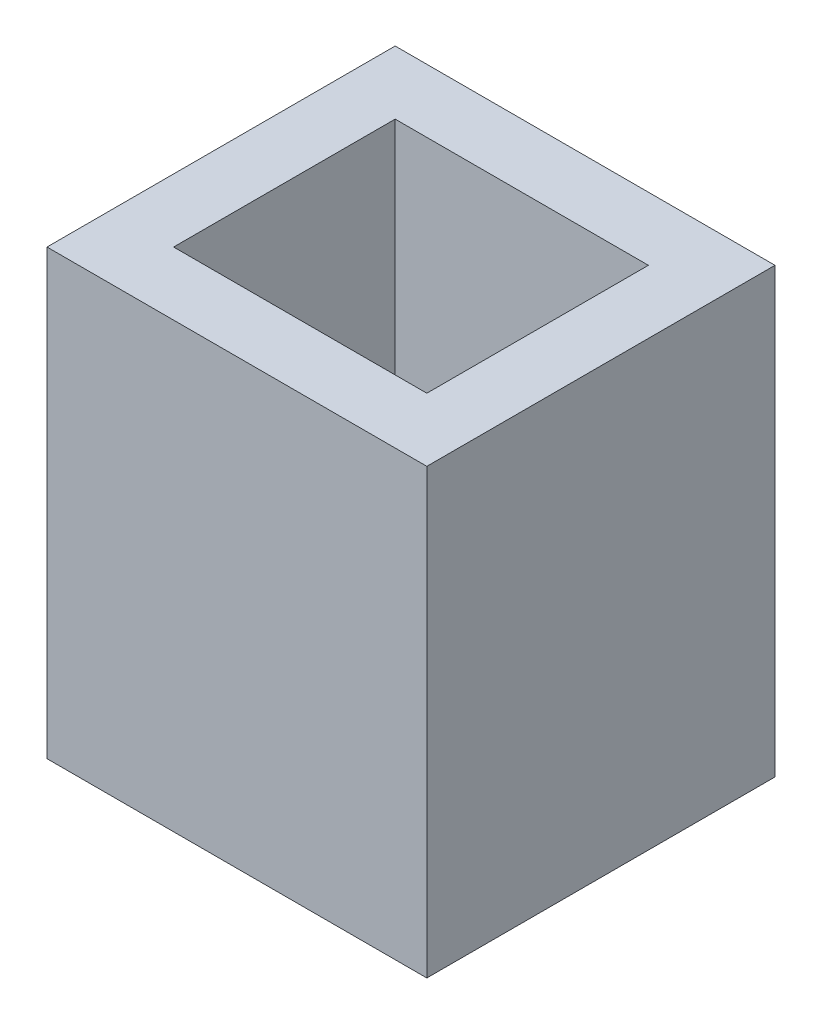
ISO-10303-21;
HEADER;
FILE_DESCRIPTION(('STEP AP214'),'2;1');
FILE_NAME('part.step','',(''),(''),'','','');
FILE_SCHEMA(('AUTOMOTIVE_DESIGN { 1 0 10303 214 1 1 1 1 }'));
ENDSEC;
DATA;
#1=APPLICATION_CONTEXT('core data for automotive mechanical design processes');
#2=APPLICATION_PROTOCOL_DEFINITION('international standard','automotive_design',2000,#1);
#3=PRODUCT_CONTEXT('',#1,'mechanical');
#4=PRODUCT('Part','Part','',(#3));
#5=PRODUCT_RELATED_PRODUCT_CATEGORY('part','',(#4));
#6=PRODUCT_DEFINITION_FORMATION('','',#4);
#7=PRODUCT_DEFINITION_CONTEXT('part definition',#1,'design');
#8=PRODUCT_DEFINITION('design','',#6,#7);
#9=PRODUCT_DEFINITION_SHAPE('','',#8);
#10=(LENGTH_UNIT() NAMED_UNIT(*) SI_UNIT(.MILLI.,.METRE.));
#11=(NAMED_UNIT(*) PLANE_ANGLE_UNIT() SI_UNIT($,.RADIAN.));
#12=(NAMED_UNIT(*) SI_UNIT($,.STERADIAN.) SOLID_ANGLE_UNIT());
#13=UNCERTAINTY_MEASURE_WITH_UNIT(LENGTH_MEASURE(1.E-05),#10,'distance_accuracy_value','');
#14=(GEOMETRIC_REPRESENTATION_CONTEXT(3) GLOBAL_UNCERTAINTY_ASSIGNED_CONTEXT((#13)) GLOBAL_UNIT_ASSIGNED_CONTEXT((#10,
#11,#12)) REPRESENTATION_CONTEXT('',''));
#15=CARTESIAN_POINT('',(0.,0.,0.));
#16=DIRECTION('',(0.,0.,1.));
#17=DIRECTION('',(1.,0.,0.));
#18=AXIS2_PLACEMENT_3D('',#15,#16,#17);
#19=CARTESIAN_POINT('',(0.,14.,0.));
#20=DIRECTION('',(0.,-1.,0.));
#21=DIRECTION('',(0.,0.,-1.));
#22=AXIS2_PLACEMENT_3D('',#19,#20,#21);
#23=PLANE('',#22);
#24=DIRECTION('',(0.,0.,1.));
#25=VECTOR('',#24,1.);
#26=CARTESIAN_POINT('',(0.,14.,0.));
#27=LINE('',#26,#25);
#28=CARTESIAN_POINT('',(0.,14.,-11.));
#29=VERTEX_POINT('',#28);
#30=CARTESIAN_POINT('',(0.,14.,0.));
#31=VERTEX_POINT('',#30);
#32=EDGE_CURVE('E147',#29,#31,#27,.T.);
#33=ORIENTED_EDGE('',*,*,#32,.T.);
#34=DIRECTION('',(1.,0.,0.));
#35=VECTOR('',#34,1.);
#36=CARTESIAN_POINT('',(0.,14.,0.));
#37=LINE('',#36,#35);
#38=CARTESIAN_POINT('',(12.,14.,0.));
#39=VERTEX_POINT('',#38);
#40=EDGE_CURVE('E91',#31,#39,#37,.T.);
#41=ORIENTED_EDGE('',*,*,#40,.T.);
#42=DIRECTION('',(0.,0.,-1.));
#43=VECTOR('',#42,1.);
#44=CARTESIAN_POINT('',(12.,14.,0.));
#45=LINE('',#44,#43);
#46=CARTESIAN_POINT('',(12.,14.,-11.));
#47=VERTEX_POINT('',#46);
#48=EDGE_CURVE('E150',#39,#47,#45,.T.);
#49=ORIENTED_EDGE('',*,*,#48,.T.);
#50=DIRECTION('',(-1.,0.,0.));
#51=VECTOR('',#50,1.);
#52=CARTESIAN_POINT('',(0.,14.,-11.));
#53=LINE('',#52,#51);
#54=EDGE_CURVE('E63',#47,#29,#53,.T.);
#55=ORIENTED_EDGE('',*,*,#54,.T.);
#56=EDGE_LOOP('',(#33,#41,#49,#55));
#57=FACE_BOUND('',#56,.T.);
#58=DIRECTION('',(0.,0.,1.));
#59=VECTOR('',#58,1.);
#60=CARTESIAN_POINT('',(2.,14.,0.));
#61=LINE('',#60,#59);
#62=CARTESIAN_POINT('',(2.,14.,-9.));
#63=VERTEX_POINT('',#62);
#64=CARTESIAN_POINT('',(2.,14.,-2.));
#65=VERTEX_POINT('',#64);
#66=EDGE_CURVE('E136',#63,#65,#61,.T.);
#67=ORIENTED_EDGE('',*,*,#66,.F.);
#68=DIRECTION('',(-1.,0.,0.));
#69=VECTOR('',#68,1.);
#70=CARTESIAN_POINT('',(0.,14.,-9.));
#71=LINE('',#70,#69);
#72=CARTESIAN_POINT('',(10.,14.,-9.));
#73=VERTEX_POINT('',#72);
#74=EDGE_CURVE('E145',#73,#63,#71,.T.);
#75=ORIENTED_EDGE('',*,*,#74,.F.);
#76=DIRECTION('',(0.,0.,-1.));
#77=VECTOR('',#76,1.);
#78=CARTESIAN_POINT('',(10.,14.,0.));
#79=LINE('',#78,#77);
#80=CARTESIAN_POINT('',(10.,14.,-2.));
#81=VERTEX_POINT('',#80);
#82=EDGE_CURVE('E143',#81,#73,#79,.T.);
#83=ORIENTED_EDGE('',*,*,#82,.F.);
#84=DIRECTION('',(1.,0.,0.));
#85=VECTOR('',#84,1.);
#86=CARTESIAN_POINT('',(0.,14.,-2.));
#87=LINE('',#86,#85);
#88=EDGE_CURVE('E128',#65,#81,#87,.T.);
#89=ORIENTED_EDGE('',*,*,#88,.F.);
#90=EDGE_LOOP('',(#67,#75,#83,#89));
#91=FACE_BOUND('',#90,.T.);
#92=ADVANCED_FACE('F37',(#57,#91),#23,.F.);
#93=CARTESIAN_POINT('',(0.,14.,0.));
#94=DIRECTION('',(1.,0.,0.));
#95=DIRECTION('',(0.,0.,-1.));
#96=AXIS2_PLACEMENT_3D('',#93,#94,#95);
#97=PLANE('',#96);
#98=DIRECTION('',(0.,0.,1.));
#99=VECTOR('',#98,1.);
#100=CARTESIAN_POINT('',(0.,0.,0.));
#101=LINE('',#100,#99);
#102=CARTESIAN_POINT('',(0.,0.,-11.));
#103=VERTEX_POINT('',#102);
#104=CARTESIAN_POINT('',(0.,0.,0.));
#105=VERTEX_POINT('',#104);
#106=EDGE_CURVE('E154',#103,#105,#101,.T.);
#107=ORIENTED_EDGE('',*,*,#106,.T.);
#108=DIRECTION('',(0.,-1.,0.));
#109=VECTOR('',#108,1.);
#110=CARTESIAN_POINT('',(0.,14.,0.));
#111=LINE('',#110,#109);
#112=EDGE_CURVE('E11',#31,#105,#111,.T.);
#113=ORIENTED_EDGE('',*,*,#112,.F.);
#114=ORIENTED_EDGE('',*,*,#32,.F.);
#115=DIRECTION('',(0.,-1.,0.));
#116=VECTOR('',#115,1.);
#117=CARTESIAN_POINT('',(0.,14.,-11.));
#118=LINE('',#117,#116);
#119=EDGE_CURVE('E153',#29,#103,#118,.T.);
#120=ORIENTED_EDGE('',*,*,#119,.T.);
#121=EDGE_LOOP('',(#107,#113,#114,#120));
#122=FACE_BOUND('',#121,.T.);
#123=ADVANCED_FACE('F39',(#122),#97,.F.);
#124=CARTESIAN_POINT('',(0.,14.,0.));
#125=DIRECTION('',(0.,0.,-1.));
#126=DIRECTION('',(-1.,0.,0.));
#127=AXIS2_PLACEMENT_3D('',#124,#125,#126);
#128=PLANE('',#127);
#129=DIRECTION('',(1.,0.,0.));
#130=VECTOR('',#129,1.);
#131=CARTESIAN_POINT('',(0.,0.,0.));
#132=LINE('',#131,#130);
#133=CARTESIAN_POINT('',(12.,0.,0.));
#134=VERTEX_POINT('',#133);
#135=EDGE_CURVE('E157',#105,#134,#132,.T.);
#136=ORIENTED_EDGE('',*,*,#135,.T.);
#137=DIRECTION('',(0.,-1.,0.));
#138=VECTOR('',#137,1.);
#139=CARTESIAN_POINT('',(12.,14.,0.));
#140=LINE('',#139,#138);
#141=EDGE_CURVE('E46',#39,#134,#140,.T.);
#142=ORIENTED_EDGE('',*,*,#141,.F.);
#143=ORIENTED_EDGE('',*,*,#40,.F.);
#144=ORIENTED_EDGE('',*,*,#112,.T.);
#145=EDGE_LOOP('',(#136,#142,#143,#144));
#146=FACE_BOUND('',#145,.T.);
#147=ADVANCED_FACE('F196',(#146),#128,.F.);
#148=CARTESIAN_POINT('',(12.,14.,0.));
#149=DIRECTION('',(-1.,0.,0.));
#150=DIRECTION('',(0.,0.,1.));
#151=AXIS2_PLACEMENT_3D('',#148,#149,#150);
#152=PLANE('',#151);
#153=DIRECTION('',(0.,0.,-1.));
#154=VECTOR('',#153,1.);
#155=CARTESIAN_POINT('',(12.,0.,0.));
#156=LINE('',#155,#154);
#157=CARTESIAN_POINT('',(12.,0.,-11.));
#158=VERTEX_POINT('',#157);
#159=EDGE_CURVE('E159',#134,#158,#156,.T.);
#160=ORIENTED_EDGE('',*,*,#159,.T.);
#161=DIRECTION('',(0.,-1.,0.));
#162=VECTOR('',#161,1.);
#163=CARTESIAN_POINT('',(12.,14.,-11.));
#164=LINE('',#163,#162);
#165=EDGE_CURVE('E163',#47,#158,#164,.T.);
#166=ORIENTED_EDGE('',*,*,#165,.F.);
#167=ORIENTED_EDGE('',*,*,#48,.F.);
#168=ORIENTED_EDGE('',*,*,#141,.T.);
#169=EDGE_LOOP('',(#160,#166,#167,#168));
#170=FACE_BOUND('',#169,.T.);
#171=ADVANCED_FACE('F208',(#170),#152,.F.);
#172=CARTESIAN_POINT('',(0.,14.,-11.));
#173=DIRECTION('',(0.,0.,1.));
#174=DIRECTION('',(1.,0.,0.));
#175=AXIS2_PLACEMENT_3D('',#172,#173,#174);
#176=PLANE('',#175);
#177=DIRECTION('',(-1.,0.,0.));
#178=VECTOR('',#177,1.);
#179=CARTESIAN_POINT('',(0.,0.,-11.));
#180=LINE('',#179,#178);
#181=EDGE_CURVE('E84',#158,#103,#180,.T.);
#182=ORIENTED_EDGE('',*,*,#181,.T.);
#183=ORIENTED_EDGE('',*,*,#119,.F.);
#184=ORIENTED_EDGE('',*,*,#54,.F.);
#185=ORIENTED_EDGE('',*,*,#165,.T.);
#186=EDGE_LOOP('',(#182,#183,#184,#185));
#187=FACE_BOUND('',#186,.T.);
#188=ADVANCED_FACE('F204',(#187),#176,.F.);
#189=CARTESIAN_POINT('',(0.,0.,0.));
#190=DIRECTION('',(0.,-1.,0.));
#191=DIRECTION('',(0.,0.,-1.));
#192=AXIS2_PLACEMENT_3D('',#189,#190,#191);
#193=PLANE('',#192);
#194=CARTESIAN_POINT('',(3.45289967304959,0.,-7.28987770960184));
#195=DIRECTION('',(0.,-1.,0.));
#196=DIRECTION('',(0.,0.,-1.));
#197=AXIS2_PLACEMENT_3D('',#194,#195,#196);
#198=CIRCLE('',#197,0.75);
#199=CARTESIAN_POINT('',(3.45289967304959,0.,-8.03987770960184));
#200=VERTEX_POINT('',#199);
#201=EDGE_CURVE('E170',#200,#200,#198,.T.);
#202=ORIENTED_EDGE('',*,*,#201,.F.);
#203=EDGE_LOOP('',(#202));
#204=FACE_BOUND('',#203,.T.);
#205=CARTESIAN_POINT('',(5.99289967304959,0.,-7.28987770960184));
#206=DIRECTION('',(0.,-1.,0.));
#207=DIRECTION('',(0.,0.,-1.));
#208=AXIS2_PLACEMENT_3D('',#205,#206,#207);
#209=CIRCLE('',#208,0.75);
#210=CARTESIAN_POINT('',(5.99289967304959,0.,-8.03987770960184));
#211=VERTEX_POINT('',#210);
#212=EDGE_CURVE('E352',#211,#211,#209,.T.);
#213=ORIENTED_EDGE('',*,*,#212,.F.);
#214=EDGE_LOOP('',(#213));
#215=FACE_BOUND('',#214,.T.);
#216=CARTESIAN_POINT('',(8.53289967304959,0.,-7.28987770960184));
#217=DIRECTION('',(0.,-1.,0.));
#218=DIRECTION('',(0.,0.,-1.));
#219=AXIS2_PLACEMENT_3D('',#216,#217,#218);
#220=CIRCLE('',#219,0.75);
#221=CARTESIAN_POINT('',(8.53289967304959,0.,-8.03987770960184));
#222=VERTEX_POINT('',#221);
#223=EDGE_CURVE('E180',#222,#222,#220,.T.);
#224=ORIENTED_EDGE('',*,*,#223,.F.);
#225=EDGE_LOOP('',(#224));
#226=FACE_BOUND('',#225,.T.);
#227=ORIENTED_EDGE('',*,*,#106,.F.);
#228=ORIENTED_EDGE('',*,*,#181,.F.);
#229=ORIENTED_EDGE('',*,*,#159,.F.);
#230=ORIENTED_EDGE('',*,*,#135,.F.);
#231=EDGE_LOOP('',(#227,#228,#229,#230));
#232=FACE_BOUND('',#231,.T.);
#233=ADVANCED_FACE('F201',(#204,#215,#226,#232),#193,.T.);
#234=CARTESIAN_POINT('',(2.,14.,0.));
#235=DIRECTION('',(1.,0.,0.));
#236=DIRECTION('',(0.,0.,-1.));
#237=AXIS2_PLACEMENT_3D('',#234,#235,#236);
#238=PLANE('',#237);
#239=DIRECTION('',(0.,0.,1.));
#240=VECTOR('',#239,1.);
#241=CARTESIAN_POINT('',(2.,2.,0.));
#242=LINE('',#241,#240);
#243=CARTESIAN_POINT('',(2.,2.,-9.));
#244=VERTEX_POINT('',#243);
#245=CARTESIAN_POINT('',(2.,2.,-2.));
#246=VERTEX_POINT('',#245);
#247=EDGE_CURVE('E119',#244,#246,#242,.T.);
#248=ORIENTED_EDGE('',*,*,#247,.F.);
#249=DIRECTION('',(0.,-1.,0.));
#250=VECTOR('',#249,1.);
#251=CARTESIAN_POINT('',(2.,14.,-9.));
#252=LINE('',#251,#250);
#253=EDGE_CURVE('E139',#63,#244,#252,.T.);
#254=ORIENTED_EDGE('',*,*,#253,.F.);
#255=ORIENTED_EDGE('',*,*,#66,.T.);
#256=DIRECTION('',(0.,-1.,0.));
#257=VECTOR('',#256,1.);
#258=CARTESIAN_POINT('',(2.,14.,-2.));
#259=LINE('',#258,#257);
#260=EDGE_CURVE('E131',#65,#246,#259,.T.);
#261=ORIENTED_EDGE('',*,*,#260,.T.);
#262=EDGE_LOOP('',(#248,#254,#255,#261));
#263=FACE_BOUND('',#262,.T.);
#264=ADVANCED_FACE('F189',(#263),#238,.T.);
#265=CARTESIAN_POINT('',(0.,14.,-2.));
#266=DIRECTION('',(0.,0.,-1.));
#267=DIRECTION('',(-1.,0.,0.));
#268=AXIS2_PLACEMENT_3D('',#265,#266,#267);
#269=PLANE('',#268);
#270=DIRECTION('',(1.,0.,0.));
#271=VECTOR('',#270,1.);
#272=CARTESIAN_POINT('',(0.,2.,-2.));
#273=LINE('',#272,#271);
#274=CARTESIAN_POINT('',(10.,2.,-2.));
#275=VERTEX_POINT('',#274);
#276=EDGE_CURVE('E113',#246,#275,#273,.T.);
#277=ORIENTED_EDGE('',*,*,#276,.F.);
#278=ORIENTED_EDGE('',*,*,#260,.F.);
#279=ORIENTED_EDGE('',*,*,#88,.T.);
#280=DIRECTION('',(0.,-1.,0.));
#281=VECTOR('',#280,1.);
#282=CARTESIAN_POINT('',(10.,14.,-2.));
#283=LINE('',#282,#281);
#284=EDGE_CURVE('E125',#81,#275,#283,.T.);
#285=ORIENTED_EDGE('',*,*,#284,.T.);
#286=EDGE_LOOP('',(#277,#278,#279,#285));
#287=FACE_BOUND('',#286,.T.);
#288=ADVANCED_FACE('F126',(#287),#269,.T.);
#289=CARTESIAN_POINT('',(10.,14.,0.));
#290=DIRECTION('',(-1.,0.,0.));
#291=DIRECTION('',(0.,0.,1.));
#292=AXIS2_PLACEMENT_3D('',#289,#290,#291);
#293=PLANE('',#292);
#294=DIRECTION('',(0.,0.,-1.));
#295=VECTOR('',#294,1.);
#296=CARTESIAN_POINT('',(10.,2.,0.));
#297=LINE('',#296,#295);
#298=CARTESIAN_POINT('',(10.,2.,-9.));
#299=VERTEX_POINT('',#298);
#300=EDGE_CURVE('E117',#275,#299,#297,.T.);
#301=ORIENTED_EDGE('',*,*,#300,.F.);
#302=ORIENTED_EDGE('',*,*,#284,.F.);
#303=ORIENTED_EDGE('',*,*,#82,.T.);
#304=DIRECTION('',(0.,-1.,0.));
#305=VECTOR('',#304,1.);
#306=CARTESIAN_POINT('',(10.,14.,-9.));
#307=LINE('',#306,#305);
#308=EDGE_CURVE('E54',#73,#299,#307,.T.);
#309=ORIENTED_EDGE('',*,*,#308,.T.);
#310=EDGE_LOOP('',(#301,#302,#303,#309));
#311=FACE_BOUND('',#310,.T.);
#312=ADVANCED_FACE('F133',(#311),#293,.T.);
#313=CARTESIAN_POINT('',(0.,14.,-9.));
#314=DIRECTION('',(0.,0.,1.));
#315=DIRECTION('',(1.,0.,0.));
#316=AXIS2_PLACEMENT_3D('',#313,#314,#315);
#317=PLANE('',#316);
#318=DIRECTION('',(-1.,0.,0.));
#319=VECTOR('',#318,1.);
#320=CARTESIAN_POINT('',(0.,2.,-9.));
#321=LINE('',#320,#319);
#322=EDGE_CURVE('E134',#299,#244,#321,.T.);
#323=ORIENTED_EDGE('',*,*,#322,.F.);
#324=ORIENTED_EDGE('',*,*,#308,.F.);
#325=ORIENTED_EDGE('',*,*,#74,.T.);
#326=ORIENTED_EDGE('',*,*,#253,.T.);
#327=EDGE_LOOP('',(#323,#324,#325,#326));
#328=FACE_BOUND('',#327,.T.);
#329=ADVANCED_FACE('F185',(#328),#317,.T.);
#330=CARTESIAN_POINT('',(0.,2.,0.));
#331=DIRECTION('',(0.,-1.,0.));
#332=DIRECTION('',(0.,0.,-1.));
#333=AXIS2_PLACEMENT_3D('',#330,#331,#332);
#334=PLANE('',#333);
#335=CARTESIAN_POINT('',(3.45289967304959,2.,-7.28987770960184));
#336=DIRECTION('',(0.,-1.,0.));
#337=DIRECTION('',(0.,0.,-1.));
#338=AXIS2_PLACEMENT_3D('',#335,#336,#337);
#339=CIRCLE('',#338,0.75);
#340=CARTESIAN_POINT('',(3.45289967304959,2.,-8.03987770960184));
#341=VERTEX_POINT('',#340);
#342=EDGE_CURVE('E41',#341,#341,#339,.T.);
#343=ORIENTED_EDGE('',*,*,#342,.T.);
#344=EDGE_LOOP('',(#343));
#345=FACE_BOUND('',#344,.T.);
#346=CARTESIAN_POINT('',(5.99289967304959,2.,-7.28987770960184));
#347=DIRECTION('',(0.,-1.,0.));
#348=DIRECTION('',(0.,0.,-1.));
#349=AXIS2_PLACEMENT_3D('',#346,#347,#348);
#350=CIRCLE('',#349,0.75);
#351=CARTESIAN_POINT('',(5.99289967304959,2.,-8.03987770960184));
#352=VERTEX_POINT('',#351);
#353=EDGE_CURVE('E169',#352,#352,#350,.T.);
#354=ORIENTED_EDGE('',*,*,#353,.T.);
#355=EDGE_LOOP('',(#354));
#356=FACE_BOUND('',#355,.T.);
#357=CARTESIAN_POINT('',(8.53289967304959,2.,-7.28987770960184));
#358=DIRECTION('',(0.,-1.,0.));
#359=DIRECTION('',(0.,0.,-1.));
#360=AXIS2_PLACEMENT_3D('',#357,#358,#359);
#361=CIRCLE('',#360,0.75);
#362=CARTESIAN_POINT('',(8.53289967304959,2.,-8.03987770960184));
#363=VERTEX_POINT('',#362);
#364=EDGE_CURVE('E167',#363,#363,#361,.T.);
#365=ORIENTED_EDGE('',*,*,#364,.T.);
#366=EDGE_LOOP('',(#365));
#367=FACE_BOUND('',#366,.T.);
#368=ORIENTED_EDGE('',*,*,#247,.T.);
#369=ORIENTED_EDGE('',*,*,#276,.T.);
#370=ORIENTED_EDGE('',*,*,#300,.T.);
#371=ORIENTED_EDGE('',*,*,#322,.T.);
#372=EDGE_LOOP('',(#368,#369,#370,#371));
#373=FACE_BOUND('',#372,.T.);
#374=ADVANCED_FACE('F115',(#345,#356,#367,#373),#334,.F.);
#375=CARTESIAN_POINT('',(8.53289967304959,10.,-7.28987770960184));
#376=DIRECTION('',(0.,-1.,0.));
#377=DIRECTION('',(0.,0.,-1.));
#378=AXIS2_PLACEMENT_3D('',#375,#376,#377);
#379=CYLINDRICAL_SURFACE('',#378,0.75);
#380=ORIENTED_EDGE('',*,*,#223,.T.);
#381=EDGE_LOOP('',(#380));
#382=FACE_BOUND('',#381,.T.);
#383=ORIENTED_EDGE('',*,*,#364,.F.);
#384=EDGE_LOOP('',(#383));
#385=FACE_BOUND('',#384,.T.);
#386=ADVANCED_FACE('F264',(#382,#385),#379,.F.);
#387=CARTESIAN_POINT('',(5.99289967304959,10.,-7.28987770960184));
#388=DIRECTION('',(0.,-1.,0.));
#389=DIRECTION('',(0.,0.,-1.));
#390=AXIS2_PLACEMENT_3D('',#387,#388,#389);
#391=CYLINDRICAL_SURFACE('',#390,0.75);
#392=ORIENTED_EDGE('',*,*,#212,.T.);
#393=EDGE_LOOP('',(#392));
#394=FACE_BOUND('',#393,.T.);
#395=ORIENTED_EDGE('',*,*,#353,.F.);
#396=EDGE_LOOP('',(#395));
#397=FACE_BOUND('',#396,.T.);
#398=ADVANCED_FACE('F270',(#394,#397),#391,.F.);
#399=CARTESIAN_POINT('',(3.45289967304959,10.,-7.28987770960184));
#400=DIRECTION('',(0.,-1.,0.));
#401=DIRECTION('',(0.,0.,-1.));
#402=AXIS2_PLACEMENT_3D('',#399,#400,#401);
#403=CYLINDRICAL_SURFACE('',#402,0.75);
#404=ORIENTED_EDGE('',*,*,#201,.T.);
#405=EDGE_LOOP('',(#404));
#406=FACE_BOUND('',#405,.T.);
#407=ORIENTED_EDGE('',*,*,#342,.F.);
#408=EDGE_LOOP('',(#407));
#409=FACE_BOUND('',#408,.T.);
#410=ADVANCED_FACE('F278',(#406,#409),#403,.F.);
#411=CLOSED_SHELL('',(#92,#123,#147,#171,#188,#233,#264,#288,#312,#329,#374,#386,#398,#410));
#412=MANIFOLD_SOLID_BREP('B2',#411);
#413=ADVANCED_BREP_SHAPE_REPRESENTATION('',(#18,#412),#14);
#414=SHAPE_DEFINITION_REPRESENTATION(#9,#413);
ENDSEC;
END-ISO-10303-21;
